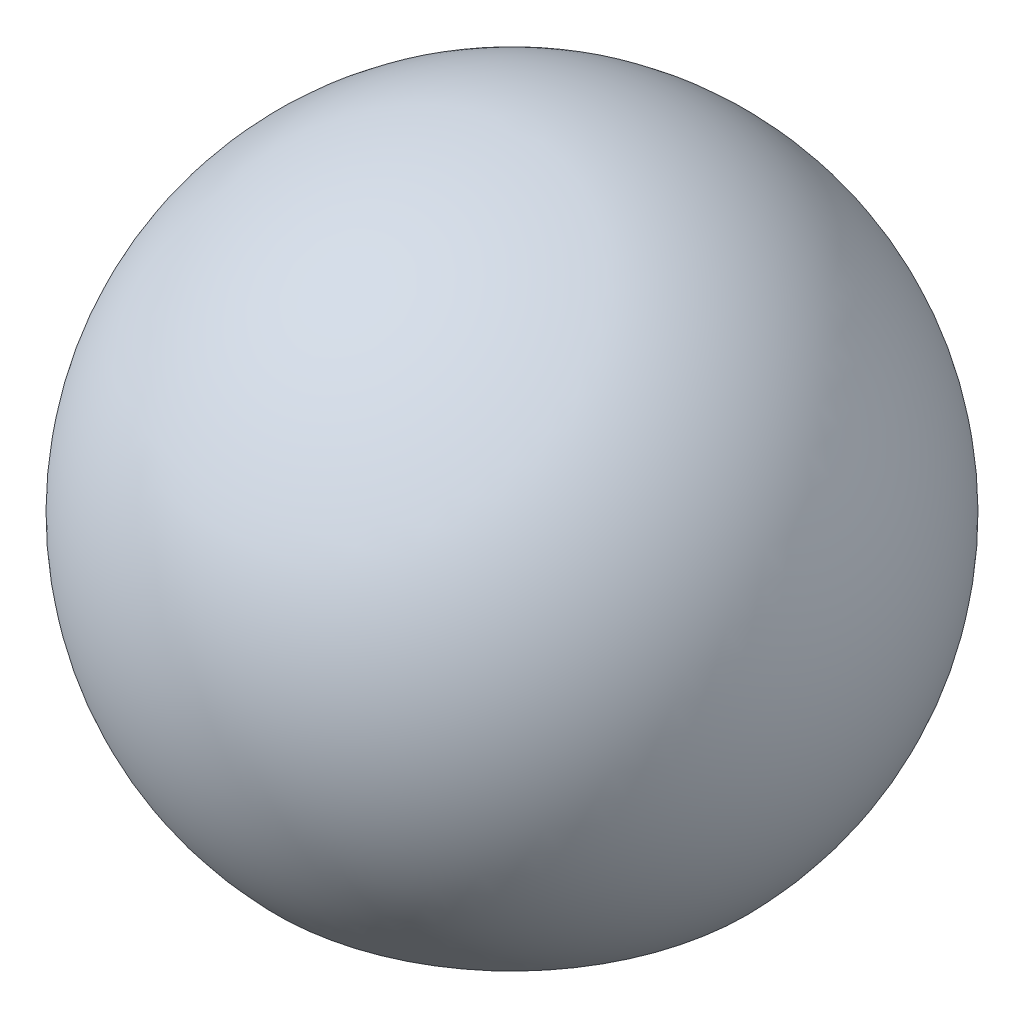
ISO-10303-21;
HEADER;
FILE_DESCRIPTION(('STEP AP214'),'2;1');
FILE_NAME('part.step','',(''),(''),'','','');
FILE_SCHEMA(('AUTOMOTIVE_DESIGN { 1 0 10303 214 1 1 1 1 }'));
ENDSEC;
DATA;
#1=APPLICATION_CONTEXT('core data for automotive mechanical design processes');
#2=APPLICATION_PROTOCOL_DEFINITION('international standard','automotive_design',2000,#1);
#3=PRODUCT_CONTEXT('',#1,'mechanical');
#4=PRODUCT('Part','Part','',(#3));
#5=PRODUCT_RELATED_PRODUCT_CATEGORY('part','',(#4));
#6=PRODUCT_DEFINITION_FORMATION('','',#4);
#7=PRODUCT_DEFINITION_CONTEXT('part definition',#1,'design');
#8=PRODUCT_DEFINITION('design','',#6,#7);
#9=PRODUCT_DEFINITION_SHAPE('','',#8);
#10=(LENGTH_UNIT() NAMED_UNIT(*) SI_UNIT(.MILLI.,.METRE.));
#11=(NAMED_UNIT(*) PLANE_ANGLE_UNIT() SI_UNIT($,.RADIAN.));
#12=(NAMED_UNIT(*) SI_UNIT($,.STERADIAN.) SOLID_ANGLE_UNIT());
#13=UNCERTAINTY_MEASURE_WITH_UNIT(LENGTH_MEASURE(1.E-05),#10,'distance_accuracy_value','');
#14=(GEOMETRIC_REPRESENTATION_CONTEXT(3) GLOBAL_UNCERTAINTY_ASSIGNED_CONTEXT((#13)) GLOBAL_UNIT_ASSIGNED_CONTEXT((#10,
#11,#12)) REPRESENTATION_CONTEXT('',''));
#15=CARTESIAN_POINT('',(0.,0.,0.));
#16=DIRECTION('',(0.,0.,1.));
#17=DIRECTION('',(1.,0.,0.));
#18=AXIS2_PLACEMENT_3D('',#15,#16,#17);
#19=CARTESIAN_POINT('',(2.5,-2.44948974278318,0.));
#20=DIRECTION('',(0.,-1.,0.));
#21=DIRECTION('',(1.,0.,0.));
#22=AXIS2_PLACEMENT_3D('',#19,#20,#21);
#23=PLANE('',#22);
#24=CARTESIAN_POINT('',(0.,-2.44948974278318,0.));
#25=DIRECTION('',(0.,-1.,0.));
#26=DIRECTION('',(1.,0.,0.));
#27=AXIS2_PLACEMENT_3D('',#24,#25,#26);
#28=CIRCLE('',#27,2.5);
#29=CARTESIAN_POINT('',(2.5,-2.44948974278318,0.));
#30=VERTEX_POINT('',#29);
#31=EDGE_CURVE('E10',#30,#30,#28,.T.);
#32=ORIENTED_EDGE('',*,*,#31,.T.);
#33=EDGE_LOOP('',(#32));
#34=FACE_BOUND('',#33,.T.);
#35=ADVANCED_FACE('F31',(#34),#23,.T.);
#36=CARTESIAN_POINT('',(0.,0.,0.));
#37=DIRECTION('',(0.,-1.,0.));
#38=DIRECTION('',(1.,0.,0.));
#39=AXIS2_PLACEMENT_3D('',#36,#37,#38);
#40=SPHERICAL_SURFACE('',#39,3.5);
#41=ORIENTED_EDGE('',*,*,#31,.F.);
#42=EDGE_LOOP('',(#41));
#43=FACE_BOUND('',#42,.T.);
#44=ADVANCED_FACE('F39',(#43),#40,.T.);
#45=CLOSED_SHELL('',(#35,#44));
#46=MANIFOLD_SOLID_BREP('B2',#45);
#47=ADVANCED_BREP_SHAPE_REPRESENTATION('',(#18,#46),#14);
#48=SHAPE_DEFINITION_REPRESENTATION(#9,#47);
ENDSEC;
END-ISO-10303-21;
